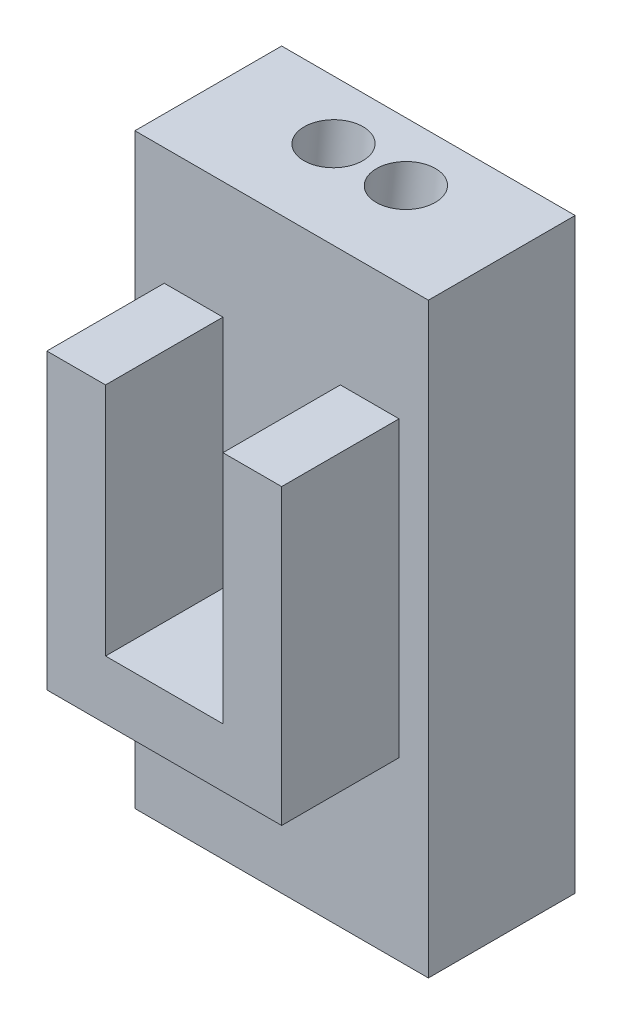
ISO-10303-21;
HEADER;
FILE_DESCRIPTION(('STEP AP214'),'2;1');
FILE_NAME('part.step','',(''),(''),'','','');
FILE_SCHEMA(('AUTOMOTIVE_DESIGN { 1 0 10303 214 1 1 1 1 }'));
ENDSEC;
DATA;
#1=APPLICATION_CONTEXT('core data for automotive mechanical design processes');
#2=APPLICATION_PROTOCOL_DEFINITION('international standard','automotive_design',2000,#1);
#3=PRODUCT_CONTEXT('',#1,'mechanical');
#4=PRODUCT('Part','Part','',(#3));
#5=PRODUCT_RELATED_PRODUCT_CATEGORY('part','',(#4));
#6=PRODUCT_DEFINITION_FORMATION('','',#4);
#7=PRODUCT_DEFINITION_CONTEXT('part definition',#1,'design');
#8=PRODUCT_DEFINITION('design','',#6,#7);
#9=PRODUCT_DEFINITION_SHAPE('','',#8);
#10=(LENGTH_UNIT() NAMED_UNIT(*) SI_UNIT(.MILLI.,.METRE.));
#11=(NAMED_UNIT(*) PLANE_ANGLE_UNIT() SI_UNIT($,.RADIAN.));
#12=(NAMED_UNIT(*) SI_UNIT($,.STERADIAN.) SOLID_ANGLE_UNIT());
#13=UNCERTAINTY_MEASURE_WITH_UNIT(LENGTH_MEASURE(1.E-05),#10,'distance_accuracy_value','');
#14=(GEOMETRIC_REPRESENTATION_CONTEXT(3) GLOBAL_UNCERTAINTY_ASSIGNED_CONTEXT((#13)) GLOBAL_UNIT_ASSIGNED_CONTEXT((#10,
#11,#12)) REPRESENTATION_CONTEXT('',''));
#15=CARTESIAN_POINT('',(0.,0.,0.));
#16=DIRECTION('',(0.,0.,1.));
#17=DIRECTION('',(1.,0.,0.));
#18=AXIS2_PLACEMENT_3D('',#15,#16,#17);
#19=CARTESIAN_POINT('',(0.648549591158839,-41.0407384203344,4.48019466881171));
#20=DIRECTION('',(0.0157073173103396,-0.993971640421492,0.108506489302346));
#21=DIRECTION('',(0.,-0.108519877130276,-0.99409427936571));
#22=AXIS2_PLACEMENT_3D('',#19,#20,#21);
#23=PLANE('',#22);
#24=CARTESIAN_POINT('',(-4.75134140539301,-39.4574476349692,19.7655840880087));
#25=DIRECTION('',(0.0157073180520602,-0.993971640294354,0.108506490359625));
#26=DIRECTION('',(0.,-0.108519878188949,-0.99409427925014));
#27=AXIS2_PLACEMENT_3D('',#24,#25,#26);
#28=CIRCLE('',#27,5.00000000305764);
#29=CARTESIAN_POINT('',(8.89243825059546E-08,-39.552037232123,18.2112972517205));
#30=VERTEX_POINT('',#29);
#31=CARTESIAN_POINT('',(-2.47964848311858E-07,-39.2144594913062,21.3036717613765));
#32=VERTEX_POINT('',#31);
#33=EDGE_CURVE('E20',#30,#32,#28,.F.);
#34=ORIENTED_EDGE('',*,*,#33,.T.);
#35=DIRECTION('',(0.,-0.108519877130276,-0.99409427936571));
#36=VECTOR('',#35,1.);
#37=CARTESIAN_POINT('',(-3.22179349171448E-11,-41.0508664826037,4.4813002944006));
#38=LINE('',#37,#36);
#39=EDGE_CURVE('E109',#32,#30,#38,.T.);
#40=ORIENTED_EDGE('',*,*,#39,.T.);
#41=EDGE_LOOP('',(#34,#40));
#42=FACE_BOUND('',#41,.T.);
#43=ADVANCED_FACE('F17',(#42),#23,.F.);
#44=CARTESIAN_POINT('',(-0.648549591158839,-41.0407384203344,4.48019466881171));
#45=DIRECTION('',(-0.0157073173103396,-0.993971640421492,0.108506489302346));
#46=DIRECTION('',(0.,-0.108519877130276,-0.99409427936571));
#47=AXIS2_PLACEMENT_3D('',#44,#45,#46);
#48=PLANE('',#47);
#49=ORIENTED_EDGE('',*,*,#39,.F.);
#50=CARTESIAN_POINT('',(4.75134140548079,-39.4574476294158,19.7655840874025));
#51=DIRECTION('',(-0.0157073180520599,-0.993971640294354,0.108506490359625));
#52=DIRECTION('',(0.,-0.10851987818895,-0.99409427925014));
#53=AXIS2_PLACEMENT_3D('',#50,#51,#52);
#54=CIRCLE('',#53,4.99999999699103);
#55=EDGE_CURVE('E115',#32,#30,#54,.F.);
#56=ORIENTED_EDGE('',*,*,#55,.T.);
#57=EDGE_LOOP('',(#49,#56));
#58=FACE_BOUND('',#57,.T.);
#59=ADVANCED_FACE('F125',(#58),#48,.F.);
#60=CARTESIAN_POINT('',(0.,0.,0.));
#61=DIRECTION('',(0.,0.,1.));
#62=DIRECTION('',(1.,0.,0.));
#63=AXIS2_PLACEMENT_3D('',#60,#61,#62);
#64=PLANE('',#63);
#65=DIRECTION('',(1.,0.,0.));
#66=VECTOR('',#65,1.);
#67=CARTESIAN_POINT('',(0.,-50.,0.));
#68=LINE('',#67,#66);
#69=CARTESIAN_POINT('',(25.,-50.,0.));
#70=VERTEX_POINT('',#69);
#71=CARTESIAN_POINT('',(-25.,-50.,0.));
#72=VERTEX_POINT('',#71);
#73=EDGE_CURVE('E156',#70,#72,#68,.F.);
#74=ORIENTED_EDGE('',*,*,#73,.T.);
#75=DIRECTION('',(0.,1.,0.));
#76=VECTOR('',#75,1.);
#77=CARTESIAN_POINT('',(-25.,0.,0.));
#78=LINE('',#77,#76);
#79=CARTESIAN_POINT('',(-25.,50.,0.));
#80=VERTEX_POINT('',#79);
#81=EDGE_CURVE('E151',#72,#80,#78,.T.);
#82=ORIENTED_EDGE('',*,*,#81,.T.);
#83=DIRECTION('',(1.,0.,0.));
#84=VECTOR('',#83,1.);
#85=CARTESIAN_POINT('',(0.,50.,0.));
#86=LINE('',#85,#84);
#87=CARTESIAN_POINT('',(25.,50.,0.));
#88=VERTEX_POINT('',#87);
#89=EDGE_CURVE('E138',#80,#88,#86,.T.);
#90=ORIENTED_EDGE('',*,*,#89,.T.);
#91=DIRECTION('',(0.,1.,0.));
#92=VECTOR('',#91,1.);
#93=CARTESIAN_POINT('',(25.,0.,0.));
#94=LINE('',#93,#92);
#95=EDGE_CURVE('E121',#88,#70,#94,.F.);
#96=ORIENTED_EDGE('',*,*,#95,.T.);
#97=EDGE_LOOP('',(#74,#82,#90,#96));
#98=FACE_BOUND('',#97,.T.);
#99=ADVANCED_FACE('F162',(#98),#64,.F.);
#100=CARTESIAN_POINT('',(-6.18234463586959,51.0975805085384,9.8801830464264));
#101=DIRECTION('',(0.0157073180520602,-0.993971640294354,0.108506490359625));
#102=DIRECTION('',(0.,-0.108519878188949,-0.99409427925014));
#103=AXIS2_PLACEMENT_3D('',#100,#101,#102);
#104=CYLINDRICAL_SURFACE('',#103,5.00000000305764);
#105=CARTESIAN_POINT('',(0.,-340.126129243386,52.5879525337759));
#106=DIRECTION('',(1.,0.,0.));
#107=DIRECTION('',(0.,-0.99409427925014,0.10851987818895));
#108=AXIS2_PLACEMENT_3D('',#105,#106,#107);
#109=ELLIPSE('',#108,318.322961529951,5.00000000002433);
#110=EDGE_CURVE('E116',#30,#32,#109,.T.);
#111=ORIENTED_EDGE('',*,*,#110,.T.);
#112=ORIENTED_EDGE('',*,*,#33,.F.);
#113=EDGE_LOOP('',(#111,#112));
#114=FACE_BOUND('',#113,.T.);
#115=CARTESIAN_POINT('',(-6.16500003021239,50.,9.99999995471704));
#116=DIRECTION('',(0.,-1.,0.));
#117=DIRECTION('',(0.14326594539039,0.,0.98968422685794));
#118=AXIS2_PLACEMENT_3D('',#115,#116,#117);
#119=ELLIPSE('',#118,5.03032460923829,5.00000000305764);
#120=CARTESIAN_POINT('',(-5.44432581944932,50.,14.9784328764555));
#121=VERTEX_POINT('',#120);
#122=EDGE_CURVE('E134',#121,#121,#119,.F.);
#123=ORIENTED_EDGE('',*,*,#122,.T.);
#124=EDGE_LOOP('',(#123));
#125=FACE_BOUND('',#124,.T.);
#126=ADVANCED_FACE('F118',(#114,#125),#104,.F.);
#127=CARTESIAN_POINT('',(6.17401538142012,50.5704986298792,9.93772171500304));
#128=DIRECTION('',(-0.0157073180520599,-0.993971640294354,0.108506490359625));
#129=DIRECTION('',(0.,-0.10851987818895,-0.99409427925014));
#130=AXIS2_PLACEMENT_3D('',#127,#128,#129);
#131=CYLINDRICAL_SURFACE('',#130,4.99999999699103);
#132=CARTESIAN_POINT('',(6.16500003021239,50.,9.99999995471704));
#133=DIRECTION('',(0.,-1.,0.));
#134=DIRECTION('',(-0.143265945390388,0.,0.98968422685794));
#135=AXIS2_PLACEMENT_3D('',#132,#133,#134);
#136=ELLIPSE('',#135,5.03032460313489,4.99999999699103);
#137=CARTESIAN_POINT('',(5.44432582032374,50.,14.9784328704151));
#138=VERTEX_POINT('',#137);
#139=EDGE_CURVE('E130',#138,#138,#136,.F.);
#140=ORIENTED_EDGE('',*,*,#139,.T.);
#141=EDGE_LOOP('',(#140));
#142=FACE_BOUND('',#141,.T.);
#143=ORIENTED_EDGE('',*,*,#55,.F.);
#144=ORIENTED_EDGE('',*,*,#110,.F.);
#145=EDGE_LOOP('',(#143,#144));
#146=FACE_BOUND('',#145,.T.);
#147=ADVANCED_FACE('F123',(#142,#146),#131,.F.);
#148=CARTESIAN_POINT('',(25.,0.,0.));
#149=DIRECTION('',(-1.,0.,0.));
#150=DIRECTION('',(0.,0.,1.));
#151=AXIS2_PLACEMENT_3D('',#148,#149,#150);
#152=PLANE('',#151);
#153=ORIENTED_EDGE('',*,*,#95,.F.);
#154=DIRECTION('',(0.,0.,-1.));
#155=VECTOR('',#154,1.);
#156=CARTESIAN_POINT('',(25.,50.,0.));
#157=LINE('',#156,#155);
#158=CARTESIAN_POINT('',(25.,50.,25.));
#159=VERTEX_POINT('',#158);
#160=EDGE_CURVE('E136',#88,#159,#157,.F.);
#161=ORIENTED_EDGE('',*,*,#160,.T.);
#162=DIRECTION('',(0.,1.,0.));
#163=VECTOR('',#162,1.);
#164=CARTESIAN_POINT('',(25.,0.,25.));
#165=LINE('',#164,#163);
#166=CARTESIAN_POINT('',(25.,-50.,25.));
#167=VERTEX_POINT('',#166);
#168=EDGE_CURVE('E177',#159,#167,#165,.F.);
#169=ORIENTED_EDGE('',*,*,#168,.T.);
#170=DIRECTION('',(0.,0.,1.));
#171=VECTOR('',#170,1.);
#172=CARTESIAN_POINT('',(25.,-50.,0.));
#173=LINE('',#172,#171);
#174=EDGE_CURVE('E157',#167,#70,#173,.F.);
#175=ORIENTED_EDGE('',*,*,#174,.T.);
#176=EDGE_LOOP('',(#153,#161,#169,#175));
#177=FACE_BOUND('',#176,.T.);
#178=ADVANCED_FACE('F164',(#177),#152,.F.);
#179=CARTESIAN_POINT('',(0.,-50.,0.));
#180=DIRECTION('',(0.,1.,0.));
#181=DIRECTION('',(0.,0.,1.));
#182=AXIS2_PLACEMENT_3D('',#179,#180,#181);
#183=PLANE('',#182);
#184=ORIENTED_EDGE('',*,*,#73,.F.);
#185=ORIENTED_EDGE('',*,*,#174,.F.);
#186=DIRECTION('',(1.,0.,0.));
#187=VECTOR('',#186,1.);
#188=CARTESIAN_POINT('',(0.,-50.,25.));
#189=LINE('',#188,#187);
#190=CARTESIAN_POINT('',(-25.,-50.,25.));
#191=VERTEX_POINT('',#190);
#192=EDGE_CURVE('E179',#167,#191,#189,.F.);
#193=ORIENTED_EDGE('',*,*,#192,.T.);
#194=DIRECTION('',(0.,0.,-1.));
#195=VECTOR('',#194,1.);
#196=CARTESIAN_POINT('',(-25.,-50.,0.));
#197=LINE('',#196,#195);
#198=EDGE_CURVE('E153',#191,#72,#197,.T.);
#199=ORIENTED_EDGE('',*,*,#198,.T.);
#200=EDGE_LOOP('',(#184,#185,#193,#199));
#201=FACE_BOUND('',#200,.T.);
#202=ADVANCED_FACE('F243',(#201),#183,.F.);
#203=CARTESIAN_POINT('',(-25.,0.,0.));
#204=DIRECTION('',(1.,0.,0.));
#205=DIRECTION('',(0.,0.,-1.));
#206=AXIS2_PLACEMENT_3D('',#203,#204,#205);
#207=PLANE('',#206);
#208=ORIENTED_EDGE('',*,*,#81,.F.);
#209=ORIENTED_EDGE('',*,*,#198,.F.);
#210=DIRECTION('',(0.,1.,0.));
#211=VECTOR('',#210,1.);
#212=CARTESIAN_POINT('',(-25.,0.,25.));
#213=LINE('',#212,#211);
#214=CARTESIAN_POINT('',(-25.,50.,25.));
#215=VERTEX_POINT('',#214);
#216=EDGE_CURVE('E174',#191,#215,#213,.T.);
#217=ORIENTED_EDGE('',*,*,#216,.T.);
#218=DIRECTION('',(0.,0.,-1.));
#219=VECTOR('',#218,1.);
#220=CARTESIAN_POINT('',(-25.,50.,0.));
#221=LINE('',#220,#219);
#222=EDGE_CURVE('E144',#215,#80,#221,.T.);
#223=ORIENTED_EDGE('',*,*,#222,.T.);
#224=EDGE_LOOP('',(#208,#209,#217,#223));
#225=FACE_BOUND('',#224,.T.);
#226=ADVANCED_FACE('F241',(#225),#207,.F.);
#227=CARTESIAN_POINT('',(0.,50.,0.));
#228=DIRECTION('',(0.,-1.,0.));
#229=DIRECTION('',(0.,0.,-1.));
#230=AXIS2_PLACEMENT_3D('',#227,#228,#229);
#231=PLANE('',#230);
#232=ORIENTED_EDGE('',*,*,#139,.F.);
#233=EDGE_LOOP('',(#232));
#234=FACE_BOUND('',#233,.T.);
#235=ORIENTED_EDGE('',*,*,#122,.F.);
#236=EDGE_LOOP('',(#235));
#237=FACE_BOUND('',#236,.T.);
#238=ORIENTED_EDGE('',*,*,#89,.F.);
#239=ORIENTED_EDGE('',*,*,#222,.F.);
#240=DIRECTION('',(1.,0.,0.));
#241=VECTOR('',#240,1.);
#242=CARTESIAN_POINT('',(0.,50.,25.));
#243=LINE('',#242,#241);
#244=EDGE_CURVE('E169',#215,#159,#243,.T.);
#245=ORIENTED_EDGE('',*,*,#244,.T.);
#246=ORIENTED_EDGE('',*,*,#160,.F.);
#247=EDGE_LOOP('',(#238,#239,#245,#246));
#248=FACE_BOUND('',#247,.T.);
#249=ADVANCED_FACE('F166',(#234,#237,#248),#231,.F.);
#250=CARTESIAN_POINT('',(0.,-20.,0.));
#251=DIRECTION('',(0.,-1.,0.));
#252=DIRECTION('',(0.,0.,-1.));
#253=AXIS2_PLACEMENT_3D('',#250,#251,#252);
#254=PLANE('',#253);
#255=DIRECTION('',(1.,0.,0.));
#256=VECTOR('',#255,1.);
#257=CARTESIAN_POINT('',(0.,-20.,25.));
#258=LINE('',#257,#256);
#259=CARTESIAN_POINT('',(-20.,-20.,25.));
#260=VERTEX_POINT('',#259);
#261=CARTESIAN_POINT('',(20.,-20.,25.));
#262=VERTEX_POINT('',#261);
#263=EDGE_CURVE('E214',#260,#262,#258,.T.);
#264=ORIENTED_EDGE('',*,*,#263,.T.);
#265=DIRECTION('',(0.,0.,-1.));
#266=VECTOR('',#265,1.);
#267=CARTESIAN_POINT('',(20.,-20.,0.));
#268=LINE('',#267,#266);
#269=CARTESIAN_POINT('',(20.,-20.,45.));
#270=VERTEX_POINT('',#269);
#271=EDGE_CURVE('E133',#262,#270,#268,.F.);
#272=ORIENTED_EDGE('',*,*,#271,.T.);
#273=DIRECTION('',(1.,0.,0.));
#274=VECTOR('',#273,1.);
#275=CARTESIAN_POINT('',(0.,-20.,45.));
#276=LINE('',#275,#274);
#277=CARTESIAN_POINT('',(-20.,-20.,45.));
#278=VERTEX_POINT('',#277);
#279=EDGE_CURVE('E189',#270,#278,#276,.F.);
#280=ORIENTED_EDGE('',*,*,#279,.T.);
#281=DIRECTION('',(0.,0.,1.));
#282=VECTOR('',#281,1.);
#283=CARTESIAN_POINT('',(-20.,-20.,0.));
#284=LINE('',#283,#282);
#285=EDGE_CURVE('E180',#278,#260,#284,.F.);
#286=ORIENTED_EDGE('',*,*,#285,.T.);
#287=EDGE_LOOP('',(#264,#272,#280,#286));
#288=FACE_BOUND('',#287,.T.);
#289=ADVANCED_FACE('F211',(#288),#254,.T.);
#290=CARTESIAN_POINT('',(20.,0.,0.));
#291=DIRECTION('',(1.,0.,0.));
#292=DIRECTION('',(0.,0.,-1.));
#293=AXIS2_PLACEMENT_3D('',#290,#291,#292);
#294=PLANE('',#293);
#295=DIRECTION('',(0.,1.,0.));
#296=VECTOR('',#295,1.);
#297=CARTESIAN_POINT('',(20.,0.,25.));
#298=LINE('',#297,#296);
#299=CARTESIAN_POINT('',(20.,30.,25.));
#300=VERTEX_POINT('',#299);
#301=EDGE_CURVE('E233',#262,#300,#298,.T.);
#302=ORIENTED_EDGE('',*,*,#301,.T.);
#303=DIRECTION('',(0.,0.,1.));
#304=VECTOR('',#303,1.);
#305=CARTESIAN_POINT('',(20.,30.,0.));
#306=LINE('',#305,#304);
#307=CARTESIAN_POINT('',(20.,30.,45.));
#308=VERTEX_POINT('',#307);
#309=EDGE_CURVE('E206',#300,#308,#306,.T.);
#310=ORIENTED_EDGE('',*,*,#309,.T.);
#311=DIRECTION('',(0.,1.,0.));
#312=VECTOR('',#311,1.);
#313=CARTESIAN_POINT('',(20.,0.,45.));
#314=LINE('',#313,#312);
#315=EDGE_CURVE('E191',#308,#270,#314,.F.);
#316=ORIENTED_EDGE('',*,*,#315,.T.);
#317=ORIENTED_EDGE('',*,*,#271,.F.);
#318=EDGE_LOOP('',(#302,#310,#316,#317));
#319=FACE_BOUND('',#318,.T.);
#320=ADVANCED_FACE('F217',(#319),#294,.T.);
#321=CARTESIAN_POINT('',(0.,30.,0.));
#322=DIRECTION('',(0.,1.,0.));
#323=DIRECTION('',(0.,0.,1.));
#324=AXIS2_PLACEMENT_3D('',#321,#322,#323);
#325=PLANE('',#324);
#326=DIRECTION('',(1.,0.,0.));
#327=VECTOR('',#326,1.);
#328=CARTESIAN_POINT('',(0.,30.,25.));
#329=LINE('',#328,#327);
#330=CARTESIAN_POINT('',(10.,30.,25.));
#331=VERTEX_POINT('',#330);
#332=EDGE_CURVE('E235',#300,#331,#329,.F.);
#333=ORIENTED_EDGE('',*,*,#332,.T.);
#334=DIRECTION('',(0.,0.,1.));
#335=VECTOR('',#334,1.);
#336=CARTESIAN_POINT('',(10.,30.,0.));
#337=LINE('',#336,#335);
#338=CARTESIAN_POINT('',(10.,30.,45.));
#339=VERTEX_POINT('',#338);
#340=EDGE_CURVE('E205',#331,#339,#337,.T.);
#341=ORIENTED_EDGE('',*,*,#340,.T.);
#342=DIRECTION('',(1.,0.,0.));
#343=VECTOR('',#342,1.);
#344=CARTESIAN_POINT('',(0.,30.,45.));
#345=LINE('',#344,#343);
#346=EDGE_CURVE('E194',#339,#308,#345,.T.);
#347=ORIENTED_EDGE('',*,*,#346,.T.);
#348=ORIENTED_EDGE('',*,*,#309,.F.);
#349=EDGE_LOOP('',(#333,#341,#347,#348));
#350=FACE_BOUND('',#349,.T.);
#351=ADVANCED_FACE('F277',(#350),#325,.T.);
#352=CARTESIAN_POINT('',(10.,0.,0.));
#353=DIRECTION('',(-1.,0.,0.));
#354=DIRECTION('',(0.,0.,1.));
#355=AXIS2_PLACEMENT_3D('',#352,#353,#354);
#356=PLANE('',#355);
#357=DIRECTION('',(0.,1.,0.));
#358=VECTOR('',#357,1.);
#359=CARTESIAN_POINT('',(10.,0.,25.));
#360=LINE('',#359,#358);
#361=CARTESIAN_POINT('',(10.,-10.,25.));
#362=VERTEX_POINT('',#361);
#363=EDGE_CURVE('E417',#331,#362,#360,.F.);
#364=ORIENTED_EDGE('',*,*,#363,.T.);
#365=DIRECTION('',(0.,0.,1.));
#366=VECTOR('',#365,1.);
#367=CARTESIAN_POINT('',(10.,-10.,0.));
#368=LINE('',#367,#366);
#369=CARTESIAN_POINT('',(10.,-10.,45.));
#370=VERTEX_POINT('',#369);
#371=EDGE_CURVE('E203',#362,#370,#368,.T.);
#372=ORIENTED_EDGE('',*,*,#371,.T.);
#373=DIRECTION('',(0.,1.,0.));
#374=VECTOR('',#373,1.);
#375=CARTESIAN_POINT('',(10.,0.,45.));
#376=LINE('',#375,#374);
#377=EDGE_CURVE('E197',#370,#339,#376,.T.);
#378=ORIENTED_EDGE('',*,*,#377,.T.);
#379=ORIENTED_EDGE('',*,*,#340,.F.);
#380=EDGE_LOOP('',(#364,#372,#378,#379));
#381=FACE_BOUND('',#380,.T.);
#382=ADVANCED_FACE('F273',(#381),#356,.T.);
#383=CARTESIAN_POINT('',(0.,-10.,0.));
#384=DIRECTION('',(0.,1.,0.));
#385=DIRECTION('',(0.,0.,1.));
#386=AXIS2_PLACEMENT_3D('',#383,#384,#385);
#387=PLANE('',#386);
#388=DIRECTION('',(1.,0.,0.));
#389=VECTOR('',#388,1.);
#390=CARTESIAN_POINT('',(0.,-10.,25.));
#391=LINE('',#390,#389);
#392=CARTESIAN_POINT('',(-10.,-10.,25.));
#393=VERTEX_POINT('',#392);
#394=EDGE_CURVE('E421',#362,#393,#391,.F.);
#395=ORIENTED_EDGE('',*,*,#394,.T.);
#396=DIRECTION('',(0.,0.,-1.));
#397=VECTOR('',#396,1.);
#398=CARTESIAN_POINT('',(-10.,-10.,0.));
#399=LINE('',#398,#397);
#400=CARTESIAN_POINT('',(-10.,-10.,45.));
#401=VERTEX_POINT('',#400);
#402=EDGE_CURVE('E429',#393,#401,#399,.F.);
#403=ORIENTED_EDGE('',*,*,#402,.T.);
#404=DIRECTION('',(1.,0.,0.));
#405=VECTOR('',#404,1.);
#406=CARTESIAN_POINT('',(0.,-10.,45.));
#407=LINE('',#406,#405);
#408=EDGE_CURVE('E200',#401,#370,#407,.T.);
#409=ORIENTED_EDGE('',*,*,#408,.T.);
#410=ORIENTED_EDGE('',*,*,#371,.F.);
#411=EDGE_LOOP('',(#395,#403,#409,#410));
#412=FACE_BOUND('',#411,.T.);
#413=ADVANCED_FACE('F270',(#412),#387,.T.);
#414=CARTESIAN_POINT('',(0.,0.,45.));
#415=DIRECTION('',(0.,0.,1.));
#416=DIRECTION('',(1.,0.,0.));
#417=AXIS2_PLACEMENT_3D('',#414,#415,#416);
#418=PLANE('',#417);
#419=DIRECTION('',(0.,1.,0.));
#420=VECTOR('',#419,1.);
#421=CARTESIAN_POINT('',(-20.,0.,45.));
#422=LINE('',#421,#420);
#423=CARTESIAN_POINT('',(-20.,30.,45.));
#424=VERTEX_POINT('',#423);
#425=EDGE_CURVE('E183',#424,#278,#422,.F.);
#426=ORIENTED_EDGE('',*,*,#425,.T.);
#427=ORIENTED_EDGE('',*,*,#279,.F.);
#428=ORIENTED_EDGE('',*,*,#315,.F.);
#429=ORIENTED_EDGE('',*,*,#346,.F.);
#430=ORIENTED_EDGE('',*,*,#377,.F.);
#431=ORIENTED_EDGE('',*,*,#408,.F.);
#432=DIRECTION('',(0.,1.,0.));
#433=VECTOR('',#432,1.);
#434=CARTESIAN_POINT('',(-10.,0.,45.));
#435=LINE('',#434,#433);
#436=CARTESIAN_POINT('',(-10.,30.,45.));
#437=VERTEX_POINT('',#436);
#438=EDGE_CURVE('E423',#401,#437,#435,.T.);
#439=ORIENTED_EDGE('',*,*,#438,.T.);
#440=DIRECTION('',(1.,0.,0.));
#441=VECTOR('',#440,1.);
#442=CARTESIAN_POINT('',(0.,30.,45.));
#443=LINE('',#442,#441);
#444=EDGE_CURVE('E224',#437,#424,#443,.F.);
#445=ORIENTED_EDGE('',*,*,#444,.T.);
#446=EDGE_LOOP('',(#426,#427,#428,#429,#430,#431,#439,#445));
#447=FACE_BOUND('',#446,.T.);
#448=ADVANCED_FACE('F220',(#447),#418,.T.);
#449=CARTESIAN_POINT('',(-20.,0.,0.));
#450=DIRECTION('',(-1.,0.,0.));
#451=DIRECTION('',(0.,0.,1.));
#452=AXIS2_PLACEMENT_3D('',#449,#450,#451);
#453=PLANE('',#452);
#454=DIRECTION('',(0.,1.,0.));
#455=VECTOR('',#454,1.);
#456=CARTESIAN_POINT('',(-20.,0.,25.));
#457=LINE('',#456,#455);
#458=CARTESIAN_POINT('',(-20.,30.,25.));
#459=VERTEX_POINT('',#458);
#460=EDGE_CURVE('E173',#459,#260,#457,.F.);
#461=ORIENTED_EDGE('',*,*,#460,.T.);
#462=ORIENTED_EDGE('',*,*,#285,.F.);
#463=ORIENTED_EDGE('',*,*,#425,.F.);
#464=DIRECTION('',(0.,0.,1.));
#465=VECTOR('',#464,1.);
#466=CARTESIAN_POINT('',(-20.,30.,0.));
#467=LINE('',#466,#465);
#468=EDGE_CURVE('E229',#424,#459,#467,.F.);
#469=ORIENTED_EDGE('',*,*,#468,.T.);
#470=EDGE_LOOP('',(#461,#462,#463,#469));
#471=FACE_BOUND('',#470,.T.);
#472=ADVANCED_FACE('F228',(#471),#453,.T.);
#473=CARTESIAN_POINT('',(0.,0.,25.));
#474=DIRECTION('',(0.,0.,1.));
#475=DIRECTION('',(1.,0.,0.));
#476=AXIS2_PLACEMENT_3D('',#473,#474,#475);
#477=PLANE('',#476);
#478=ORIENTED_EDGE('',*,*,#363,.F.);
#479=ORIENTED_EDGE('',*,*,#332,.F.);
#480=ORIENTED_EDGE('',*,*,#301,.F.);
#481=ORIENTED_EDGE('',*,*,#263,.F.);
#482=ORIENTED_EDGE('',*,*,#460,.F.);
#483=DIRECTION('',(1.,0.,0.));
#484=VECTOR('',#483,1.);
#485=CARTESIAN_POINT('',(0.,30.,25.));
#486=LINE('',#485,#484);
#487=CARTESIAN_POINT('',(-10.,30.,25.));
#488=VERTEX_POINT('',#487);
#489=EDGE_CURVE('E26',#459,#488,#486,.T.);
#490=ORIENTED_EDGE('',*,*,#489,.T.);
#491=DIRECTION('',(0.,1.,0.));
#492=VECTOR('',#491,1.);
#493=CARTESIAN_POINT('',(-10.,0.,25.));
#494=LINE('',#493,#492);
#495=EDGE_CURVE('E427',#488,#393,#494,.F.);
#496=ORIENTED_EDGE('',*,*,#495,.T.);
#497=ORIENTED_EDGE('',*,*,#394,.F.);
#498=EDGE_LOOP('',(#478,#479,#480,#481,#482,#490,#496,#497));
#499=FACE_BOUND('',#498,.T.);
#500=ORIENTED_EDGE('',*,*,#216,.F.);
#501=ORIENTED_EDGE('',*,*,#192,.F.);
#502=ORIENTED_EDGE('',*,*,#168,.F.);
#503=ORIENTED_EDGE('',*,*,#244,.F.);
#504=EDGE_LOOP('',(#500,#501,#502,#503));
#505=FACE_BOUND('',#504,.T.);
#506=ADVANCED_FACE('F178',(#499,#505),#477,.T.);
#507=CARTESIAN_POINT('',(-10.,0.,0.));
#508=DIRECTION('',(1.,0.,0.));
#509=DIRECTION('',(0.,0.,-1.));
#510=AXIS2_PLACEMENT_3D('',#507,#508,#509);
#511=PLANE('',#510);
#512=ORIENTED_EDGE('',*,*,#495,.F.);
#513=DIRECTION('',(0.,0.,1.));
#514=VECTOR('',#513,1.);
#515=CARTESIAN_POINT('',(-10.,30.,0.));
#516=LINE('',#515,#514);
#517=EDGE_CURVE('E11',#488,#437,#516,.T.);
#518=ORIENTED_EDGE('',*,*,#517,.T.);
#519=ORIENTED_EDGE('',*,*,#438,.F.);
#520=ORIENTED_EDGE('',*,*,#402,.F.);
#521=EDGE_LOOP('',(#512,#518,#519,#520));
#522=FACE_BOUND('',#521,.T.);
#523=ADVANCED_FACE('F255',(#522),#511,.T.);
#524=CARTESIAN_POINT('',(0.,30.,0.));
#525=DIRECTION('',(0.,1.,0.));
#526=DIRECTION('',(0.,0.,1.));
#527=AXIS2_PLACEMENT_3D('',#524,#525,#526);
#528=PLANE('',#527);
#529=ORIENTED_EDGE('',*,*,#489,.F.);
#530=ORIENTED_EDGE('',*,*,#468,.F.);
#531=ORIENTED_EDGE('',*,*,#444,.F.);
#532=ORIENTED_EDGE('',*,*,#517,.F.);
#533=EDGE_LOOP('',(#529,#530,#531,#532));
#534=FACE_BOUND('',#533,.T.);
#535=ADVANCED_FACE('F253',(#534),#528,.T.);
#536=CLOSED_SHELL('',(#43,#59,#99,#126,#147,#178,#202,#226,#249,#289,#320,#351,#382,#413,#448,
#472,#506,#523,#535));
#537=MANIFOLD_SOLID_BREP('B1',#536);
#538=ADVANCED_BREP_SHAPE_REPRESENTATION('',(#18,#537),#14);
#539=SHAPE_DEFINITION_REPRESENTATION(#9,#538);
ENDSEC;
END-ISO-10303-21;
